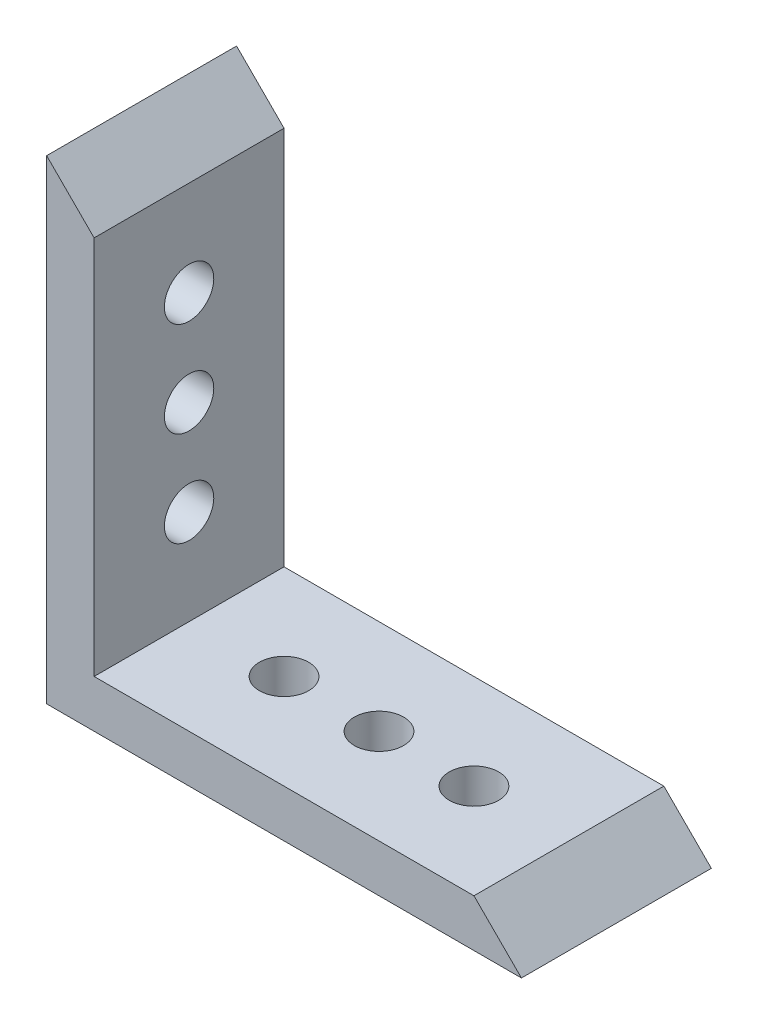
ISO-10303-21;
HEADER;
FILE_DESCRIPTION(('STEP AP214'),'2;1');
FILE_NAME('part.step','',(''),(''),'','','');
FILE_SCHEMA(('AUTOMOTIVE_DESIGN { 1 0 10303 214 1 1 1 1 }'));
ENDSEC;
DATA;
#1=APPLICATION_CONTEXT('core data for automotive mechanical design processes');
#2=APPLICATION_PROTOCOL_DEFINITION('international standard','automotive_design',2000,#1);
#3=PRODUCT_CONTEXT('',#1,'mechanical');
#4=PRODUCT('Part','Part','',(#3));
#5=PRODUCT_RELATED_PRODUCT_CATEGORY('part','',(#4));
#6=PRODUCT_DEFINITION_FORMATION('','',#4);
#7=PRODUCT_DEFINITION_CONTEXT('part definition',#1,'design');
#8=PRODUCT_DEFINITION('design','',#6,#7);
#9=PRODUCT_DEFINITION_SHAPE('','',#8);
#10=(LENGTH_UNIT() NAMED_UNIT(*) SI_UNIT(.MILLI.,.METRE.));
#11=(NAMED_UNIT(*) PLANE_ANGLE_UNIT() SI_UNIT($,.RADIAN.));
#12=(NAMED_UNIT(*) SI_UNIT($,.STERADIAN.) SOLID_ANGLE_UNIT());
#13=UNCERTAINTY_MEASURE_WITH_UNIT(LENGTH_MEASURE(1.E-05),#10,'distance_accuracy_value','');
#14=(GEOMETRIC_REPRESENTATION_CONTEXT(3) GLOBAL_UNCERTAINTY_ASSIGNED_CONTEXT((#13)) GLOBAL_UNIT_ASSIGNED_CONTEXT((#10,
#11,#12)) REPRESENTATION_CONTEXT('',''));
#15=CARTESIAN_POINT('',(0.,0.,0.));
#16=DIRECTION('',(0.,0.,1.));
#17=DIRECTION('',(1.,0.,0.));
#18=AXIS2_PLACEMENT_3D('',#15,#16,#17);
#19=CARTESIAN_POINT('',(0.,50.,20.));
#20=DIRECTION('',(-0.707106781186546,-0.707106781186549,0.));
#21=DIRECTION('',(0.707106781186549,-0.707106781186546,0.));
#22=AXIS2_PLACEMENT_3D('',#19,#20,#21);
#23=PLANE('',#22);
#24=DIRECTION('',(0.,0.,-1.));
#25=VECTOR('',#24,1.);
#26=CARTESIAN_POINT('',(45.0000000000002,5.,136.855865354369));
#27=LINE('',#26,#25);
#28=CARTESIAN_POINT('',(45.0000000000002,5.,20.));
#29=VERTEX_POINT('',#28);
#30=CARTESIAN_POINT('',(45.0000000000002,5.,0.));
#31=VERTEX_POINT('',#30);
#32=EDGE_CURVE('E65',#29,#31,#27,.T.);
#33=ORIENTED_EDGE('',*,*,#32,.F.);
#34=DIRECTION('',(-0.707106781186549,0.707106781186546,0.));
#35=VECTOR('',#34,1.);
#36=CARTESIAN_POINT('',(0.,50.,20.));
#37=LINE('',#36,#35);
#38=CARTESIAN_POINT('',(50.,1.8682053493363E-13,20.));
#39=VERTEX_POINT('',#38);
#40=EDGE_CURVE('E97',#39,#29,#37,.T.);
#41=ORIENTED_EDGE('',*,*,#40,.F.);
#42=DIRECTION('',(0.,0.,-1.));
#43=VECTOR('',#42,1.);
#44=CARTESIAN_POINT('',(50.,1.8682053493363E-13,20.));
#45=LINE('',#44,#43);
#46=CARTESIAN_POINT('',(50.,1.8682053493363E-13,0.));
#47=VERTEX_POINT('',#46);
#48=EDGE_CURVE('E159',#39,#47,#45,.T.);
#49=ORIENTED_EDGE('',*,*,#48,.T.);
#50=DIRECTION('',(-0.707106781186549,0.707106781186546,0.));
#51=VECTOR('',#50,1.);
#52=CARTESIAN_POINT('',(0.,50.,0.));
#53=LINE('',#52,#51);
#54=EDGE_CURVE('E148',#47,#31,#53,.T.);
#55=ORIENTED_EDGE('',*,*,#54,.T.);
#56=EDGE_LOOP('',(#33,#41,#49,#55));
#57=FACE_BOUND('',#56,.T.);
#58=ADVANCED_FACE('F49',(#57),#23,.F.);
#59=CARTESIAN_POINT('',(0.,0.,20.));
#60=DIRECTION('',(0.,0.,-1.));
#61=DIRECTION('',(-1.,0.,0.));
#62=AXIS2_PLACEMENT_3D('',#59,#60,#61);
#63=PLANE('',#62);
#64=DIRECTION('',(0.,-1.,0.));
#65=VECTOR('',#64,1.);
#66=CARTESIAN_POINT('',(5.00000000000001,0.,20.));
#67=LINE('',#66,#65);
#68=CARTESIAN_POINT('',(5.,45.0000000000002,20.));
#69=VERTEX_POINT('',#68);
#70=CARTESIAN_POINT('',(5.00000000000001,5.,20.));
#71=VERTEX_POINT('',#70);
#72=EDGE_CURVE('E113',#69,#71,#67,.T.);
#73=ORIENTED_EDGE('',*,*,#72,.F.);
#74=CARTESIAN_POINT('',(0.,50.,20.));
#75=VERTEX_POINT('',#74);
#76=EDGE_CURVE('E138',#69,#75,#37,.T.);
#77=ORIENTED_EDGE('',*,*,#76,.T.);
#78=DIRECTION('',(0.,-1.,0.));
#79=VECTOR('',#78,1.);
#80=CARTESIAN_POINT('',(0.,0.,20.));
#81=LINE('',#80,#79);
#82=CARTESIAN_POINT('',(0.,0.,20.));
#83=VERTEX_POINT('',#82);
#84=EDGE_CURVE('E74',#75,#83,#81,.T.);
#85=ORIENTED_EDGE('',*,*,#84,.T.);
#86=DIRECTION('',(1.,0.,0.));
#87=VECTOR('',#86,1.);
#88=CARTESIAN_POINT('',(50.,1.8682053493363E-13,20.));
#89=LINE('',#88,#87);
#90=EDGE_CURVE('E135',#83,#39,#89,.T.);
#91=ORIENTED_EDGE('',*,*,#90,.T.);
#92=ORIENTED_EDGE('',*,*,#40,.T.);
#93=DIRECTION('',(1.,0.,0.));
#94=VECTOR('',#93,1.);
#95=CARTESIAN_POINT('',(0.,5.,20.));
#96=LINE('',#95,#94);
#97=EDGE_CURVE('E123',#71,#29,#96,.T.);
#98=ORIENTED_EDGE('',*,*,#97,.F.);
#99=EDGE_LOOP('',(#73,#77,#85,#91,#92,#98));
#100=FACE_BOUND('',#99,.T.);
#101=ADVANCED_FACE('F129',(#100),#63,.F.);
#102=CARTESIAN_POINT('',(0.,0.,0.));
#103=DIRECTION('',(0.,0.,-1.));
#104=DIRECTION('',(-1.,0.,0.));
#105=AXIS2_PLACEMENT_3D('',#102,#103,#104);
#106=PLANE('',#105);
#107=CARTESIAN_POINT('',(5.,45.0000000000002,0.));
#108=VERTEX_POINT('',#107);
#109=CARTESIAN_POINT('',(0.,50.,0.));
#110=VERTEX_POINT('',#109);
#111=EDGE_CURVE('E147',#108,#110,#53,.T.);
#112=ORIENTED_EDGE('',*,*,#111,.F.);
#113=DIRECTION('',(0.,-1.,0.));
#114=VECTOR('',#113,1.);
#115=CARTESIAN_POINT('',(5.00000000000001,0.,0.));
#116=LINE('',#115,#114);
#117=CARTESIAN_POINT('',(5.00000000000001,5.,0.));
#118=VERTEX_POINT('',#117);
#119=EDGE_CURVE('E12',#108,#118,#116,.T.);
#120=ORIENTED_EDGE('',*,*,#119,.T.);
#121=DIRECTION('',(1.,0.,0.));
#122=VECTOR('',#121,1.);
#123=CARTESIAN_POINT('',(0.,5.,0.));
#124=LINE('',#123,#122);
#125=EDGE_CURVE('E58',#118,#31,#124,.T.);
#126=ORIENTED_EDGE('',*,*,#125,.T.);
#127=ORIENTED_EDGE('',*,*,#54,.F.);
#128=DIRECTION('',(1.,0.,0.));
#129=VECTOR('',#128,1.);
#130=CARTESIAN_POINT('',(50.,1.8682053493363E-13,0.));
#131=LINE('',#130,#129);
#132=CARTESIAN_POINT('',(0.,0.,0.));
#133=VERTEX_POINT('',#132);
#134=EDGE_CURVE('E122',#133,#47,#131,.T.);
#135=ORIENTED_EDGE('',*,*,#134,.F.);
#136=DIRECTION('',(0.,-1.,0.));
#137=VECTOR('',#136,1.);
#138=CARTESIAN_POINT('',(0.,0.,0.));
#139=LINE('',#138,#137);
#140=EDGE_CURVE('E91',#110,#133,#139,.T.);
#141=ORIENTED_EDGE('',*,*,#140,.F.);
#142=EDGE_LOOP('',(#112,#120,#126,#127,#135,#141));
#143=FACE_BOUND('',#142,.T.);
#144=ADVANCED_FACE('F164',(#143),#106,.T.);
#145=CARTESIAN_POINT('',(50.,1.8682053493363E-13,20.));
#146=DIRECTION('',(0.,1.,0.));
#147=DIRECTION('',(-1.,0.,0.));
#148=AXIS2_PLACEMENT_3D('',#145,#146,#147);
#149=PLANE('',#148);
#150=CARTESIAN_POINT('',(15.0000000000002,0.,10.));
#151=DIRECTION('',(0.,1.,0.));
#152=DIRECTION('',(0.,0.,1.));
#153=AXIS2_PLACEMENT_3D('',#150,#151,#152);
#154=CIRCLE('',#153,2.6);
#155=CARTESIAN_POINT('',(15.0000000000002,0.,12.6));
#156=VERTEX_POINT('',#155);
#157=EDGE_CURVE('E227',#156,#156,#154,.T.);
#158=ORIENTED_EDGE('',*,*,#157,.T.);
#159=EDGE_LOOP('',(#158));
#160=FACE_BOUND('',#159,.T.);
#161=CARTESIAN_POINT('',(25.0000000000002,0.,10.));
#162=DIRECTION('',(0.,1.,0.));
#163=DIRECTION('',(0.,0.,1.));
#164=AXIS2_PLACEMENT_3D('',#161,#162,#163);
#165=CIRCLE('',#164,2.6);
#166=CARTESIAN_POINT('',(25.0000000000002,0.,12.6));
#167=VERTEX_POINT('',#166);
#168=EDGE_CURVE('E239',#167,#167,#165,.T.);
#169=ORIENTED_EDGE('',*,*,#168,.T.);
#170=EDGE_LOOP('',(#169));
#171=FACE_BOUND('',#170,.T.);
#172=CARTESIAN_POINT('',(35.0000000000002,0.,10.));
#173=DIRECTION('',(0.,1.,0.));
#174=DIRECTION('',(0.,0.,1.));
#175=AXIS2_PLACEMENT_3D('',#172,#173,#174);
#176=CIRCLE('',#175,2.6);
#177=CARTESIAN_POINT('',(35.0000000000002,0.,12.6));
#178=VERTEX_POINT('',#177);
#179=EDGE_CURVE('E249',#178,#178,#176,.T.);
#180=ORIENTED_EDGE('',*,*,#179,.T.);
#181=EDGE_LOOP('',(#180));
#182=FACE_BOUND('',#181,.T.);
#183=ORIENTED_EDGE('',*,*,#134,.T.);
#184=ORIENTED_EDGE('',*,*,#48,.F.);
#185=ORIENTED_EDGE('',*,*,#90,.F.);
#186=DIRECTION('',(0.,0.,-1.));
#187=VECTOR('',#186,1.);
#188=CARTESIAN_POINT('',(0.,0.,20.));
#189=LINE('',#188,#187);
#190=EDGE_CURVE('E143',#83,#133,#189,.T.);
#191=ORIENTED_EDGE('',*,*,#190,.T.);
#192=EDGE_LOOP('',(#183,#184,#185,#191));
#193=FACE_BOUND('',#192,.T.);
#194=ADVANCED_FACE('F51',(#160,#171,#182,#193),#149,.F.);
#195=ORIENTED_EDGE('',*,*,#76,.F.);
#196=DIRECTION('',(0.,0.,-1.));
#197=VECTOR('',#196,1.);
#198=CARTESIAN_POINT('',(5.,45.0000000000002,136.855865354369));
#199=LINE('',#198,#197);
#200=EDGE_CURVE('E118',#69,#108,#199,.T.);
#201=ORIENTED_EDGE('',*,*,#200,.T.);
#202=ORIENTED_EDGE('',*,*,#111,.T.);
#203=DIRECTION('',(0.,0.,-1.));
#204=VECTOR('',#203,1.);
#205=CARTESIAN_POINT('',(0.,50.,20.));
#206=LINE('',#205,#204);
#207=EDGE_CURVE('E156',#75,#110,#206,.T.);
#208=ORIENTED_EDGE('',*,*,#207,.F.);
#209=EDGE_LOOP('',(#195,#201,#202,#208));
#210=FACE_BOUND('',#209,.T.);
#211=ADVANCED_FACE('F173',(#210),#23,.F.);
#212=CARTESIAN_POINT('',(0.,0.,20.));
#213=DIRECTION('',(1.,0.,0.));
#214=DIRECTION('',(0.,0.,-1.));
#215=AXIS2_PLACEMENT_3D('',#212,#213,#214);
#216=PLANE('',#215);
#217=CARTESIAN_POINT('',(0.,35.0000000000002,10.));
#218=DIRECTION('',(1.,0.,0.));
#219=DIRECTION('',(0.,1.,0.));
#220=AXIS2_PLACEMENT_3D('',#217,#218,#219);
#221=CIRCLE('',#220,2.6);
#222=CARTESIAN_POINT('',(0.,37.6000000000002,10.));
#223=VERTEX_POINT('',#222);
#224=EDGE_CURVE('E127',#223,#223,#221,.T.);
#225=ORIENTED_EDGE('',*,*,#224,.T.);
#226=EDGE_LOOP('',(#225));
#227=FACE_BOUND('',#226,.T.);
#228=CARTESIAN_POINT('',(0.,25.0000000000002,10.));
#229=DIRECTION('',(1.,0.,0.));
#230=DIRECTION('',(0.,1.,0.));
#231=AXIS2_PLACEMENT_3D('',#228,#229,#230);
#232=CIRCLE('',#231,2.6);
#233=CARTESIAN_POINT('',(0.,27.6000000000002,10.));
#234=VERTEX_POINT('',#233);
#235=EDGE_CURVE('E263',#234,#234,#232,.T.);
#236=ORIENTED_EDGE('',*,*,#235,.T.);
#237=EDGE_LOOP('',(#236));
#238=FACE_BOUND('',#237,.T.);
#239=CARTESIAN_POINT('',(0.,15.0000000000002,10.));
#240=DIRECTION('',(1.,0.,0.));
#241=DIRECTION('',(0.,1.,0.));
#242=AXIS2_PLACEMENT_3D('',#239,#240,#241);
#243=CIRCLE('',#242,2.6);
#244=CARTESIAN_POINT('',(0.,17.6000000000002,10.));
#245=VERTEX_POINT('',#244);
#246=EDGE_CURVE('E236',#245,#245,#243,.T.);
#247=ORIENTED_EDGE('',*,*,#246,.T.);
#248=EDGE_LOOP('',(#247));
#249=FACE_BOUND('',#248,.T.);
#250=ORIENTED_EDGE('',*,*,#140,.T.);
#251=ORIENTED_EDGE('',*,*,#190,.F.);
#252=ORIENTED_EDGE('',*,*,#84,.F.);
#253=ORIENTED_EDGE('',*,*,#207,.T.);
#254=EDGE_LOOP('',(#250,#251,#252,#253));
#255=FACE_BOUND('',#254,.T.);
#256=ADVANCED_FACE('F174',(#227,#238,#249,#255),#216,.F.);
#257=CARTESIAN_POINT('',(5.,45.0000000000002,136.855865354369));
#258=DIRECTION('',(1.,0.,0.));
#259=DIRECTION('',(0.,1.,0.));
#260=AXIS2_PLACEMENT_3D('',#257,#258,#259);
#261=PLANE('',#260);
#262=CARTESIAN_POINT('',(5.,35.0000000000002,10.));
#263=DIRECTION('',(1.,0.,0.));
#264=DIRECTION('',(0.,1.,0.));
#265=AXIS2_PLACEMENT_3D('',#262,#263,#264);
#266=CIRCLE('',#265,2.6);
#267=CARTESIAN_POINT('',(5.,37.6000000000002,10.));
#268=VERTEX_POINT('',#267);
#269=EDGE_CURVE('E255',#268,#268,#266,.T.);
#270=ORIENTED_EDGE('',*,*,#269,.F.);
#271=EDGE_LOOP('',(#270));
#272=FACE_BOUND('',#271,.T.);
#273=CARTESIAN_POINT('',(5.,25.0000000000002,10.));
#274=DIRECTION('',(1.,0.,0.));
#275=DIRECTION('',(0.,1.,0.));
#276=AXIS2_PLACEMENT_3D('',#273,#274,#275);
#277=CIRCLE('',#276,2.6);
#278=CARTESIAN_POINT('',(5.,27.6000000000002,10.));
#279=VERTEX_POINT('',#278);
#280=EDGE_CURVE('E259',#279,#279,#277,.T.);
#281=ORIENTED_EDGE('',*,*,#280,.F.);
#282=EDGE_LOOP('',(#281));
#283=FACE_BOUND('',#282,.T.);
#284=CARTESIAN_POINT('',(5.,15.0000000000002,10.));
#285=DIRECTION('',(1.,0.,0.));
#286=DIRECTION('',(0.,1.,0.));
#287=AXIS2_PLACEMENT_3D('',#284,#285,#286);
#288=CIRCLE('',#287,2.6);
#289=CARTESIAN_POINT('',(5.,17.6000000000002,10.));
#290=VERTEX_POINT('',#289);
#291=EDGE_CURVE('E267',#290,#290,#288,.T.);
#292=ORIENTED_EDGE('',*,*,#291,.F.);
#293=EDGE_LOOP('',(#292));
#294=FACE_BOUND('',#293,.T.);
#295=ORIENTED_EDGE('',*,*,#200,.F.);
#296=ORIENTED_EDGE('',*,*,#72,.T.);
#297=DIRECTION('',(0.,0.,-1.));
#298=VECTOR('',#297,1.);
#299=CARTESIAN_POINT('',(5.00000000000001,5.,136.855865354369));
#300=LINE('',#299,#298);
#301=EDGE_CURVE('E116',#71,#118,#300,.T.);
#302=ORIENTED_EDGE('',*,*,#301,.T.);
#303=ORIENTED_EDGE('',*,*,#119,.F.);
#304=EDGE_LOOP('',(#295,#296,#302,#303));
#305=FACE_BOUND('',#304,.T.);
#306=ADVANCED_FACE('F115',(#272,#283,#294,#305),#261,.T.);
#307=CARTESIAN_POINT('',(5.00000000000001,5.,136.855865354369));
#308=DIRECTION('',(0.,1.,0.));
#309=DIRECTION('',(0.,0.,1.));
#310=AXIS2_PLACEMENT_3D('',#307,#308,#309);
#311=PLANE('',#310);
#312=CARTESIAN_POINT('',(15.0000000000002,5.,10.));
#313=DIRECTION('',(0.,1.,0.));
#314=DIRECTION('',(0.,0.,1.));
#315=AXIS2_PLACEMENT_3D('',#312,#313,#314);
#316=CIRCLE('',#315,2.6);
#317=CARTESIAN_POINT('',(15.0000000000002,5.,12.6));
#318=VERTEX_POINT('',#317);
#319=EDGE_CURVE('E230',#318,#318,#316,.T.);
#320=ORIENTED_EDGE('',*,*,#319,.F.);
#321=EDGE_LOOP('',(#320));
#322=FACE_BOUND('',#321,.T.);
#323=CARTESIAN_POINT('',(25.0000000000002,5.,10.));
#324=DIRECTION('',(0.,1.,0.));
#325=DIRECTION('',(0.,0.,1.));
#326=AXIS2_PLACEMENT_3D('',#323,#324,#325);
#327=CIRCLE('',#326,2.6);
#328=CARTESIAN_POINT('',(25.0000000000002,5.,12.6));
#329=VERTEX_POINT('',#328);
#330=EDGE_CURVE('E232',#329,#329,#327,.T.);
#331=ORIENTED_EDGE('',*,*,#330,.F.);
#332=EDGE_LOOP('',(#331));
#333=FACE_BOUND('',#332,.T.);
#334=CARTESIAN_POINT('',(35.0000000000002,5.,10.));
#335=DIRECTION('',(0.,1.,0.));
#336=DIRECTION('',(0.,0.,1.));
#337=AXIS2_PLACEMENT_3D('',#334,#335,#336);
#338=CIRCLE('',#337,2.6);
#339=CARTESIAN_POINT('',(35.0000000000002,5.,12.6));
#340=VERTEX_POINT('',#339);
#341=EDGE_CURVE('E245',#340,#340,#338,.T.);
#342=ORIENTED_EDGE('',*,*,#341,.F.);
#343=EDGE_LOOP('',(#342));
#344=FACE_BOUND('',#343,.T.);
#345=ORIENTED_EDGE('',*,*,#301,.F.);
#346=ORIENTED_EDGE('',*,*,#97,.T.);
#347=ORIENTED_EDGE('',*,*,#32,.T.);
#348=ORIENTED_EDGE('',*,*,#125,.F.);
#349=EDGE_LOOP('',(#345,#346,#347,#348));
#350=FACE_BOUND('',#349,.T.);
#351=ADVANCED_FACE('F125',(#322,#333,#344,#350),#311,.T.);
#352=CARTESIAN_POINT('',(0.,15.0000000000002,10.));
#353=DIRECTION('',(1.,0.,0.));
#354=DIRECTION('',(0.,1.,0.));
#355=AXIS2_PLACEMENT_3D('',#352,#353,#354);
#356=CYLINDRICAL_SURFACE('',#355,2.6);
#357=ORIENTED_EDGE('',*,*,#246,.F.);
#358=EDGE_LOOP('',(#357));
#359=FACE_BOUND('',#358,.T.);
#360=ORIENTED_EDGE('',*,*,#291,.T.);
#361=EDGE_LOOP('',(#360));
#362=FACE_BOUND('',#361,.T.);
#363=ADVANCED_FACE('F198',(#359,#362),#356,.F.);
#364=CARTESIAN_POINT('',(0.,25.0000000000002,10.));
#365=DIRECTION('',(1.,0.,0.));
#366=DIRECTION('',(0.,1.,0.));
#367=AXIS2_PLACEMENT_3D('',#364,#365,#366);
#368=CYLINDRICAL_SURFACE('',#367,2.6);
#369=ORIENTED_EDGE('',*,*,#235,.F.);
#370=EDGE_LOOP('',(#369));
#371=FACE_BOUND('',#370,.T.);
#372=ORIENTED_EDGE('',*,*,#280,.T.);
#373=EDGE_LOOP('',(#372));
#374=FACE_BOUND('',#373,.T.);
#375=ADVANCED_FACE('F202',(#371,#374),#368,.F.);
#376=CARTESIAN_POINT('',(0.,35.0000000000002,10.));
#377=DIRECTION('',(1.,0.,0.));
#378=DIRECTION('',(0.,1.,0.));
#379=AXIS2_PLACEMENT_3D('',#376,#377,#378);
#380=CYLINDRICAL_SURFACE('',#379,2.6);
#381=ORIENTED_EDGE('',*,*,#224,.F.);
#382=EDGE_LOOP('',(#381));
#383=FACE_BOUND('',#382,.T.);
#384=ORIENTED_EDGE('',*,*,#269,.T.);
#385=EDGE_LOOP('',(#384));
#386=FACE_BOUND('',#385,.T.);
#387=ADVANCED_FACE('F206',(#383,#386),#380,.F.);
#388=CARTESIAN_POINT('',(35.0000000000002,0.,10.));
#389=DIRECTION('',(0.,1.,0.));
#390=DIRECTION('',(0.,0.,1.));
#391=AXIS2_PLACEMENT_3D('',#388,#389,#390);
#392=CYLINDRICAL_SURFACE('',#391,2.6);
#393=ORIENTED_EDGE('',*,*,#179,.F.);
#394=EDGE_LOOP('',(#393));
#395=FACE_BOUND('',#394,.T.);
#396=ORIENTED_EDGE('',*,*,#341,.T.);
#397=EDGE_LOOP('',(#396));
#398=FACE_BOUND('',#397,.T.);
#399=ADVANCED_FACE('F210',(#395,#398),#392,.F.);
#400=CARTESIAN_POINT('',(25.0000000000002,0.,10.));
#401=DIRECTION('',(0.,1.,0.));
#402=DIRECTION('',(0.,0.,1.));
#403=AXIS2_PLACEMENT_3D('',#400,#401,#402);
#404=CYLINDRICAL_SURFACE('',#403,2.6);
#405=ORIENTED_EDGE('',*,*,#168,.F.);
#406=EDGE_LOOP('',(#405));
#407=FACE_BOUND('',#406,.T.);
#408=ORIENTED_EDGE('',*,*,#330,.T.);
#409=EDGE_LOOP('',(#408));
#410=FACE_BOUND('',#409,.T.);
#411=ADVANCED_FACE('F214',(#407,#410),#404,.F.);
#412=CARTESIAN_POINT('',(15.0000000000002,0.,10.));
#413=DIRECTION('',(0.,1.,0.));
#414=DIRECTION('',(0.,0.,1.));
#415=AXIS2_PLACEMENT_3D('',#412,#413,#414);
#416=CYLINDRICAL_SURFACE('',#415,2.6);
#417=ORIENTED_EDGE('',*,*,#157,.F.);
#418=EDGE_LOOP('',(#417));
#419=FACE_BOUND('',#418,.T.);
#420=ORIENTED_EDGE('',*,*,#319,.T.);
#421=EDGE_LOOP('',(#420));
#422=FACE_BOUND('',#421,.T.);
#423=ADVANCED_FACE('F218',(#419,#422),#416,.F.);
#424=CLOSED_SHELL('',(#58,#101,#144,#194,#211,#256,#306,#351,#363,#375,#387,#399,#411,#423));
#425=MANIFOLD_SOLID_BREP('B2',#424);
#426=ADVANCED_BREP_SHAPE_REPRESENTATION('',(#18,#425),#14);
#427=SHAPE_DEFINITION_REPRESENTATION(#9,#426);
ENDSEC;
END-ISO-10303-21;
